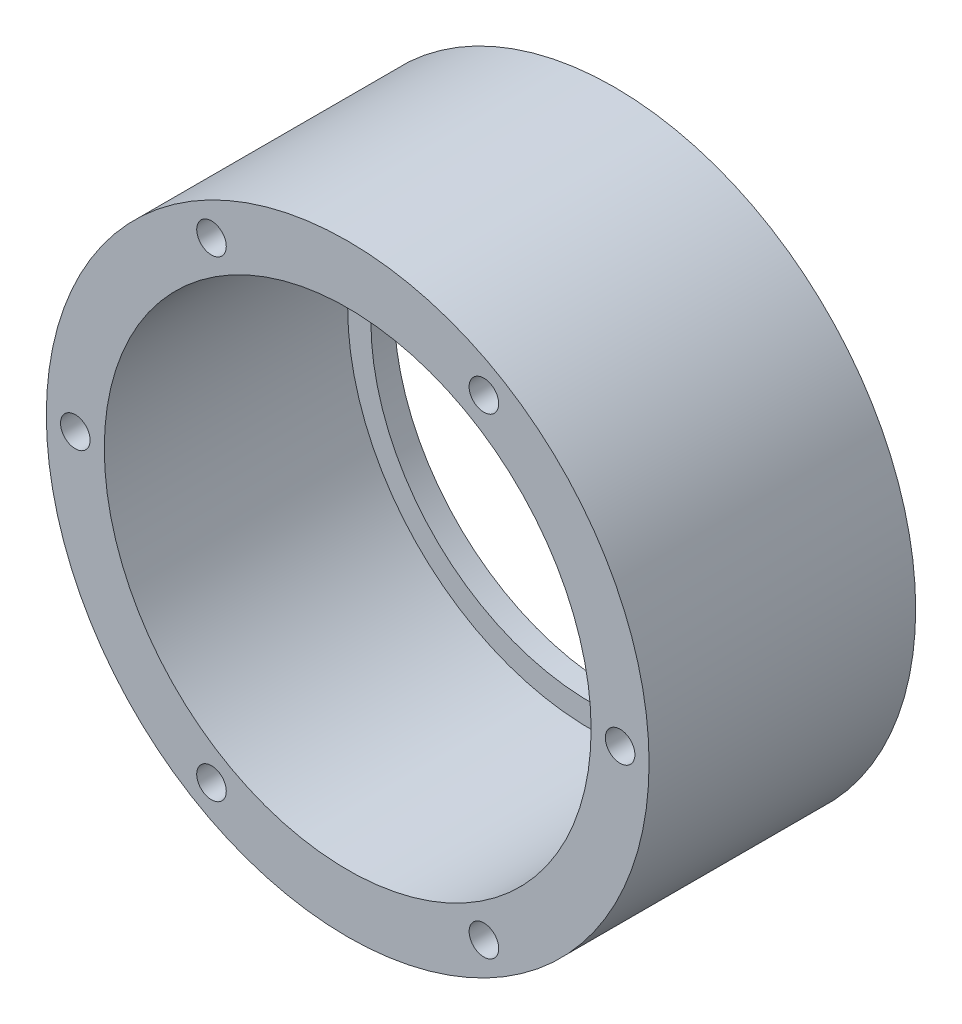
ISO-10303-21;
HEADER;
FILE_DESCRIPTION(('STEP AP214'),'2;1');
FILE_NAME('part.step','',(''),(''),'','','');
FILE_SCHEMA(('AUTOMOTIVE_DESIGN { 1 0 10303 214 1 1 1 1 }'));
ENDSEC;
DATA;
#1=APPLICATION_CONTEXT('core data for automotive mechanical design processes');
#2=APPLICATION_PROTOCOL_DEFINITION('international standard','automotive_design',2000,#1);
#3=PRODUCT_CONTEXT('',#1,'mechanical');
#4=PRODUCT('Part','Part','',(#3));
#5=PRODUCT_RELATED_PRODUCT_CATEGORY('part','',(#4));
#6=PRODUCT_DEFINITION_FORMATION('','',#4);
#7=PRODUCT_DEFINITION_CONTEXT('part definition',#1,'design');
#8=PRODUCT_DEFINITION('design','',#6,#7);
#9=PRODUCT_DEFINITION_SHAPE('','',#8);
#10=(LENGTH_UNIT() NAMED_UNIT(*) SI_UNIT(.MILLI.,.METRE.));
#11=(NAMED_UNIT(*) PLANE_ANGLE_UNIT() SI_UNIT($,.RADIAN.));
#12=(NAMED_UNIT(*) SI_UNIT($,.STERADIAN.) SOLID_ANGLE_UNIT());
#13=UNCERTAINTY_MEASURE_WITH_UNIT(LENGTH_MEASURE(1.E-05),#10,'distance_accuracy_value','');
#14=(GEOMETRIC_REPRESENTATION_CONTEXT(3) GLOBAL_UNCERTAINTY_ASSIGNED_CONTEXT((#13)) GLOBAL_UNIT_ASSIGNED_CONTEXT((#10,
#11,#12)) REPRESENTATION_CONTEXT('',''));
#15=CARTESIAN_POINT('',(0.,0.,0.));
#16=DIRECTION('',(0.,0.,1.));
#17=DIRECTION('',(1.,0.,0.));
#18=AXIS2_PLACEMENT_3D('',#15,#16,#17);
#19=CARTESIAN_POINT('',(0.,26.,-23.));
#20=DIRECTION('',(0.,0.,1.));
#21=DIRECTION('',(1.,0.,0.));
#22=AXIS2_PLACEMENT_3D('',#19,#20,#21);
#23=PLANE('',#22);
#24=CARTESIAN_POINT('',(0.,0.,-23.));
#25=DIRECTION('',(0.,0.,1.));
#26=DIRECTION('',(1.,0.,0.));
#27=AXIS2_PLACEMENT_3D('',#24,#25,#26);
#28=CIRCLE('',#27,26.);
#29=CARTESIAN_POINT('',(26.,0.,-23.));
#30=VERTEX_POINT('',#29);
#31=EDGE_CURVE('E105',#30,#30,#28,.T.);
#32=ORIENTED_EDGE('',*,*,#31,.F.);
#33=EDGE_LOOP('',(#32));
#34=FACE_BOUND('',#33,.T.);
#35=CARTESIAN_POINT('',(0.,0.,-23.));
#36=DIRECTION('',(0.,0.,1.));
#37=DIRECTION('',(1.,0.,0.));
#38=AXIS2_PLACEMENT_3D('',#35,#36,#37);
#39=CIRCLE('',#38,19.);
#40=CARTESIAN_POINT('',(19.,0.,-23.));
#41=VERTEX_POINT('',#40);
#42=EDGE_CURVE('E11',#41,#41,#39,.T.);
#43=ORIENTED_EDGE('',*,*,#42,.T.);
#44=EDGE_LOOP('',(#43));
#45=FACE_BOUND('',#44,.T.);
#46=ADVANCED_FACE('F34',(#34,#45),#23,.F.);
#47=CARTESIAN_POINT('',(0.,0.,0.));
#48=DIRECTION('',(0.,0.,1.));
#49=DIRECTION('',(1.,0.,0.));
#50=AXIS2_PLACEMENT_3D('',#47,#48,#49);
#51=CYLINDRICAL_SURFACE('',#50,19.);
#52=ORIENTED_EDGE('',*,*,#42,.F.);
#53=EDGE_LOOP('',(#52));
#54=FACE_BOUND('',#53,.T.);
#55=CARTESIAN_POINT('',(0.,0.,-21.));
#56=DIRECTION('',(0.,0.,1.));
#57=DIRECTION('',(1.,0.,0.));
#58=AXIS2_PLACEMENT_3D('',#55,#56,#57);
#59=CIRCLE('',#58,19.);
#60=CARTESIAN_POINT('',(19.,0.,-21.));
#61=VERTEX_POINT('',#60);
#62=EDGE_CURVE('E41',#61,#61,#59,.T.);
#63=ORIENTED_EDGE('',*,*,#62,.T.);
#64=EDGE_LOOP('',(#63));
#65=FACE_BOUND('',#64,.T.);
#66=ADVANCED_FACE('F119',(#54,#65),#51,.F.);
#67=CARTESIAN_POINT('',(0.,19.,-21.));
#68=DIRECTION('',(0.,0.,-1.));
#69=DIRECTION('',(-1.,0.,0.));
#70=AXIS2_PLACEMENT_3D('',#67,#68,#69);
#71=PLANE('',#70);
#72=ORIENTED_EDGE('',*,*,#62,.F.);
#73=EDGE_LOOP('',(#72));
#74=FACE_BOUND('',#73,.T.);
#75=CARTESIAN_POINT('',(0.,0.,-21.));
#76=DIRECTION('',(0.,0.,1.));
#77=DIRECTION('',(1.,0.,0.));
#78=AXIS2_PLACEMENT_3D('',#75,#76,#77);
#79=CIRCLE('',#78,21.);
#80=CARTESIAN_POINT('',(21.,0.,-21.));
#81=VERTEX_POINT('',#80);
#82=EDGE_CURVE('E114',#81,#81,#79,.T.);
#83=ORIENTED_EDGE('',*,*,#82,.T.);
#84=EDGE_LOOP('',(#83));
#85=FACE_BOUND('',#84,.T.);
#86=ADVANCED_FACE('F121',(#74,#85),#71,.F.);
#87=CARTESIAN_POINT('',(0.,0.,0.));
#88=DIRECTION('',(0.,0.,1.));
#89=DIRECTION('',(1.,0.,0.));
#90=AXIS2_PLACEMENT_3D('',#87,#88,#89);
#91=CYLINDRICAL_SURFACE('',#90,21.);
#92=ORIENTED_EDGE('',*,*,#82,.F.);
#93=EDGE_LOOP('',(#92));
#94=FACE_BOUND('',#93,.T.);
#95=CARTESIAN_POINT('',(0.,0.,0.));
#96=DIRECTION('',(0.,0.,1.));
#97=DIRECTION('',(1.,0.,0.));
#98=AXIS2_PLACEMENT_3D('',#95,#96,#97);
#99=CIRCLE('',#98,21.);
#100=CARTESIAN_POINT('',(21.,0.,0.));
#101=VERTEX_POINT('',#100);
#102=EDGE_CURVE('E111',#101,#101,#99,.T.);
#103=ORIENTED_EDGE('',*,*,#102,.T.);
#104=EDGE_LOOP('',(#103));
#105=FACE_BOUND('',#104,.T.);
#106=ADVANCED_FACE('F124',(#94,#105),#91,.F.);
#107=CARTESIAN_POINT('',(0.,21.,0.));
#108=DIRECTION('',(0.,0.,-1.));
#109=DIRECTION('',(-1.,0.,0.));
#110=AXIS2_PLACEMENT_3D('',#107,#108,#109);
#111=PLANE('',#110);
#112=CARTESIAN_POINT('',(11.7500000000002,-20.3515969889342,0.));
#113=DIRECTION('',(0.,0.,1.));
#114=DIRECTION('',(1.,0.,0.));
#115=AXIS2_PLACEMENT_3D('',#112,#113,#114);
#116=CIRCLE('',#115,1.275);
#117=CARTESIAN_POINT('',(13.0250000000002,-20.3515969889342,0.));
#118=VERTEX_POINT('',#117);
#119=EDGE_CURVE('E71',#118,#118,#116,.T.);
#120=ORIENTED_EDGE('',*,*,#119,.F.);
#121=EDGE_LOOP('',(#120));
#122=FACE_BOUND('',#121,.T.);
#123=CARTESIAN_POINT('',(-11.7499999999998,-20.3515969889344,0.));
#124=DIRECTION('',(0.,0.,1.));
#125=DIRECTION('',(1.,0.,0.));
#126=AXIS2_PLACEMENT_3D('',#123,#124,#125);
#127=CIRCLE('',#126,1.275);
#128=CARTESIAN_POINT('',(-10.4749999999998,-20.3515969889344,0.));
#129=VERTEX_POINT('',#128);
#130=EDGE_CURVE('E70',#129,#129,#127,.T.);
#131=ORIENTED_EDGE('',*,*,#130,.F.);
#132=EDGE_LOOP('',(#131));
#133=FACE_BOUND('',#132,.T.);
#134=CARTESIAN_POINT('',(-23.5,0.,0.));
#135=DIRECTION('',(0.,0.,1.));
#136=DIRECTION('',(1.,0.,0.));
#137=AXIS2_PLACEMENT_3D('',#134,#135,#136);
#138=CIRCLE('',#137,1.275);
#139=CARTESIAN_POINT('',(-22.225,0.,0.));
#140=VERTEX_POINT('',#139);
#141=EDGE_CURVE('E81',#140,#140,#138,.T.);
#142=ORIENTED_EDGE('',*,*,#141,.F.);
#143=EDGE_LOOP('',(#142));
#144=FACE_BOUND('',#143,.T.);
#145=CARTESIAN_POINT('',(-11.7500000000001,20.3515969889343,0.));
#146=DIRECTION('',(0.,0.,1.));
#147=DIRECTION('',(1.,0.,0.));
#148=AXIS2_PLACEMENT_3D('',#145,#146,#147);
#149=CIRCLE('',#148,1.275);
#150=CARTESIAN_POINT('',(-10.4750000000001,20.3515969889343,0.));
#151=VERTEX_POINT('',#150);
#152=EDGE_CURVE('E87',#151,#151,#149,.T.);
#153=ORIENTED_EDGE('',*,*,#152,.F.);
#154=EDGE_LOOP('',(#153));
#155=FACE_BOUND('',#154,.T.);
#156=CARTESIAN_POINT('',(11.75,20.3515969889343,0.));
#157=DIRECTION('',(0.,0.,1.));
#158=DIRECTION('',(1.,0.,0.));
#159=AXIS2_PLACEMENT_3D('',#156,#157,#158);
#160=CIRCLE('',#159,1.275);
#161=CARTESIAN_POINT('',(13.025,20.3515969889343,0.));
#162=VERTEX_POINT('',#161);
#163=EDGE_CURVE('E93',#162,#162,#160,.T.);
#164=ORIENTED_EDGE('',*,*,#163,.F.);
#165=EDGE_LOOP('',(#164));
#166=FACE_BOUND('',#165,.T.);
#167=CARTESIAN_POINT('',(23.5,0.,0.));
#168=DIRECTION('',(0.,0.,1.));
#169=DIRECTION('',(1.,0.,0.));
#170=AXIS2_PLACEMENT_3D('',#167,#168,#169);
#171=CIRCLE('',#170,1.275);
#172=CARTESIAN_POINT('',(24.775,0.,0.));
#173=VERTEX_POINT('',#172);
#174=EDGE_CURVE('E99',#173,#173,#171,.T.);
#175=ORIENTED_EDGE('',*,*,#174,.F.);
#176=EDGE_LOOP('',(#175));
#177=FACE_BOUND('',#176,.T.);
#178=ORIENTED_EDGE('',*,*,#102,.F.);
#179=EDGE_LOOP('',(#178));
#180=FACE_BOUND('',#179,.T.);
#181=CARTESIAN_POINT('',(0.,0.,0.));
#182=DIRECTION('',(0.,0.,1.));
#183=DIRECTION('',(1.,0.,0.));
#184=AXIS2_PLACEMENT_3D('',#181,#182,#183);
#185=CIRCLE('',#184,26.);
#186=CARTESIAN_POINT('',(26.,0.,0.));
#187=VERTEX_POINT('',#186);
#188=EDGE_CURVE('E108',#187,#187,#185,.T.);
#189=ORIENTED_EDGE('',*,*,#188,.T.);
#190=EDGE_LOOP('',(#189));
#191=FACE_BOUND('',#190,.T.);
#192=ADVANCED_FACE('F130',(#122,#133,#144,#155,#166,#177,#180,#191),#111,.F.);
#193=CARTESIAN_POINT('',(0.,0.,0.));
#194=DIRECTION('',(0.,0.,1.));
#195=DIRECTION('',(1.,0.,0.));
#196=AXIS2_PLACEMENT_3D('',#193,#194,#195);
#197=CYLINDRICAL_SURFACE('',#196,26.);
#198=ORIENTED_EDGE('',*,*,#188,.F.);
#199=EDGE_LOOP('',(#198));
#200=FACE_BOUND('',#199,.T.);
#201=ORIENTED_EDGE('',*,*,#31,.T.);
#202=EDGE_LOOP('',(#201));
#203=FACE_BOUND('',#202,.T.);
#204=ADVANCED_FACE('F136',(#200,#203),#197,.T.);
#205=CARTESIAN_POINT('',(23.5,0.,-8.));
#206=DIRECTION('',(0.,0.,1.));
#207=DIRECTION('',(1.,0.,0.));
#208=AXIS2_PLACEMENT_3D('',#205,#206,#207);
#209=CONICAL_SURFACE('',#208,1.275,1.02974425867665);
#210=CARTESIAN_POINT('',(23.5,0.,-8.76609728926014));
#211=VERTEX_POINT('',#210);
#212=VERTEX_LOOP('',#211);
#213=FACE_BOUND('',#212,.T.);
#214=CARTESIAN_POINT('',(23.5,0.,-8.));
#215=DIRECTION('',(0.,0.,1.));
#216=DIRECTION('',(1.,0.,0.));
#217=AXIS2_PLACEMENT_3D('',#214,#215,#216);
#218=CIRCLE('',#217,1.275);
#219=CARTESIAN_POINT('',(24.775,0.,-8.));
#220=VERTEX_POINT('',#219);
#221=EDGE_CURVE('E102',#220,#220,#218,.T.);
#222=ORIENTED_EDGE('',*,*,#221,.T.);
#223=EDGE_LOOP('',(#222));
#224=FACE_BOUND('',#223,.T.);
#225=ADVANCED_FACE('F143',(#213,#224),#209,.F.);
#226=CARTESIAN_POINT('',(23.5,0.,0.));
#227=DIRECTION('',(0.,0.,1.));
#228=DIRECTION('',(1.,0.,0.));
#229=AXIS2_PLACEMENT_3D('',#226,#227,#228);
#230=CYLINDRICAL_SURFACE('',#229,1.275);
#231=ORIENTED_EDGE('',*,*,#221,.F.);
#232=EDGE_LOOP('',(#231));
#233=FACE_BOUND('',#232,.T.);
#234=ORIENTED_EDGE('',*,*,#174,.T.);
#235=EDGE_LOOP('',(#234));
#236=FACE_BOUND('',#235,.T.);
#237=ADVANCED_FACE('F157',(#233,#236),#230,.F.);
#238=CARTESIAN_POINT('',(11.75,20.3515969889343,-8.));
#239=DIRECTION('',(0.,0.,1.));
#240=DIRECTION('',(1.,0.,0.));
#241=AXIS2_PLACEMENT_3D('',#238,#239,#240);
#242=CONICAL_SURFACE('',#241,1.275,1.02974425867665);
#243=CARTESIAN_POINT('',(11.75,20.3515969889343,-8.76609728926014));
#244=VERTEX_POINT('',#243);
#245=VERTEX_LOOP('',#244);
#246=FACE_BOUND('',#245,.T.);
#247=CARTESIAN_POINT('',(11.75,20.3515969889343,-8.));
#248=DIRECTION('',(0.,0.,1.));
#249=DIRECTION('',(1.,0.,0.));
#250=AXIS2_PLACEMENT_3D('',#247,#248,#249);
#251=CIRCLE('',#250,1.275);
#252=CARTESIAN_POINT('',(13.025,20.3515969889343,-8.));
#253=VERTEX_POINT('',#252);
#254=EDGE_CURVE('E96',#253,#253,#251,.T.);
#255=ORIENTED_EDGE('',*,*,#254,.T.);
#256=EDGE_LOOP('',(#255));
#257=FACE_BOUND('',#256,.T.);
#258=ADVANCED_FACE('F160',(#246,#257),#242,.F.);
#259=CARTESIAN_POINT('',(11.75,20.3515969889343,0.));
#260=DIRECTION('',(0.,0.,1.));
#261=DIRECTION('',(1.,0.,0.));
#262=AXIS2_PLACEMENT_3D('',#259,#260,#261);
#263=CYLINDRICAL_SURFACE('',#262,1.275);
#264=ORIENTED_EDGE('',*,*,#254,.F.);
#265=EDGE_LOOP('',(#264));
#266=FACE_BOUND('',#265,.T.);
#267=ORIENTED_EDGE('',*,*,#163,.T.);
#268=EDGE_LOOP('',(#267));
#269=FACE_BOUND('',#268,.T.);
#270=ADVANCED_FACE('F164',(#266,#269),#263,.F.);
#271=CARTESIAN_POINT('',(-11.7500000000001,20.3515969889343,-8.));
#272=DIRECTION('',(0.,0.,1.));
#273=DIRECTION('',(1.,0.,0.));
#274=AXIS2_PLACEMENT_3D('',#271,#272,#273);
#275=CONICAL_SURFACE('',#274,1.275,1.02974425867665);
#276=CARTESIAN_POINT('',(-11.7500000000001,20.3515969889343,-8.76609728926014));
#277=VERTEX_POINT('',#276);
#278=VERTEX_LOOP('',#277);
#279=FACE_BOUND('',#278,.T.);
#280=CARTESIAN_POINT('',(-11.7500000000001,20.3515969889343,-8.));
#281=DIRECTION('',(0.,0.,1.));
#282=DIRECTION('',(1.,0.,0.));
#283=AXIS2_PLACEMENT_3D('',#280,#281,#282);
#284=CIRCLE('',#283,1.275);
#285=CARTESIAN_POINT('',(-10.4750000000001,20.3515969889343,-8.));
#286=VERTEX_POINT('',#285);
#287=EDGE_CURVE('E90',#286,#286,#284,.T.);
#288=ORIENTED_EDGE('',*,*,#287,.T.);
#289=EDGE_LOOP('',(#288));
#290=FACE_BOUND('',#289,.T.);
#291=ADVANCED_FACE('F167',(#279,#290),#275,.F.);
#292=CARTESIAN_POINT('',(-11.7500000000001,20.3515969889343,0.));
#293=DIRECTION('',(0.,0.,1.));
#294=DIRECTION('',(1.,0.,0.));
#295=AXIS2_PLACEMENT_3D('',#292,#293,#294);
#296=CYLINDRICAL_SURFACE('',#295,1.275);
#297=ORIENTED_EDGE('',*,*,#287,.F.);
#298=EDGE_LOOP('',(#297));
#299=FACE_BOUND('',#298,.T.);
#300=ORIENTED_EDGE('',*,*,#152,.T.);
#301=EDGE_LOOP('',(#300));
#302=FACE_BOUND('',#301,.T.);
#303=ADVANCED_FACE('F171',(#299,#302),#296,.F.);
#304=CARTESIAN_POINT('',(-23.5,0.,-8.));
#305=DIRECTION('',(0.,0.,1.));
#306=DIRECTION('',(1.,0.,0.));
#307=AXIS2_PLACEMENT_3D('',#304,#305,#306);
#308=CONICAL_SURFACE('',#307,1.275,1.02974425867665);
#309=CARTESIAN_POINT('',(-23.5,0.,-8.76609728926014));
#310=VERTEX_POINT('',#309);
#311=VERTEX_LOOP('',#310);
#312=FACE_BOUND('',#311,.T.);
#313=CARTESIAN_POINT('',(-23.5,0.,-8.));
#314=DIRECTION('',(0.,0.,1.));
#315=DIRECTION('',(1.,0.,0.));
#316=AXIS2_PLACEMENT_3D('',#313,#314,#315);
#317=CIRCLE('',#316,1.275);
#318=CARTESIAN_POINT('',(-22.225,0.,-8.));
#319=VERTEX_POINT('',#318);
#320=EDGE_CURVE('E84',#319,#319,#317,.T.);
#321=ORIENTED_EDGE('',*,*,#320,.T.);
#322=EDGE_LOOP('',(#321));
#323=FACE_BOUND('',#322,.T.);
#324=ADVANCED_FACE('F175',(#312,#323),#308,.F.);
#325=CARTESIAN_POINT('',(-23.5,0.,0.));
#326=DIRECTION('',(0.,0.,1.));
#327=DIRECTION('',(1.,0.,0.));
#328=AXIS2_PLACEMENT_3D('',#325,#326,#327);
#329=CYLINDRICAL_SURFACE('',#328,1.275);
#330=ORIENTED_EDGE('',*,*,#320,.F.);
#331=EDGE_LOOP('',(#330));
#332=FACE_BOUND('',#331,.T.);
#333=ORIENTED_EDGE('',*,*,#141,.T.);
#334=EDGE_LOOP('',(#333));
#335=FACE_BOUND('',#334,.T.);
#336=ADVANCED_FACE('F179',(#332,#335),#329,.F.);
#337=CARTESIAN_POINT('',(-11.7499999999998,-20.3515969889344,-8.));
#338=DIRECTION('',(0.,0.,1.));
#339=DIRECTION('',(1.,0.,0.));
#340=AXIS2_PLACEMENT_3D('',#337,#338,#339);
#341=CONICAL_SURFACE('',#340,1.275,1.02974425867665);
#342=CARTESIAN_POINT('',(-11.7499999999998,-20.3515969889344,-8.76609728926014));
#343=VERTEX_POINT('',#342);
#344=VERTEX_LOOP('',#343);
#345=FACE_BOUND('',#344,.T.);
#346=CARTESIAN_POINT('',(-11.7499999999998,-20.3515969889344,-8.));
#347=DIRECTION('',(0.,0.,1.));
#348=DIRECTION('',(1.,0.,0.));
#349=AXIS2_PLACEMENT_3D('',#346,#347,#348);
#350=CIRCLE('',#349,1.275);
#351=CARTESIAN_POINT('',(-10.4749999999998,-20.3515969889344,-8.));
#352=VERTEX_POINT('',#351);
#353=EDGE_CURVE('E74',#352,#352,#350,.T.);
#354=ORIENTED_EDGE('',*,*,#353,.T.);
#355=EDGE_LOOP('',(#354));
#356=FACE_BOUND('',#355,.T.);
#357=ADVANCED_FACE('F183',(#345,#356),#341,.F.);
#358=CARTESIAN_POINT('',(-11.7499999999998,-20.3515969889344,0.));
#359=DIRECTION('',(0.,0.,1.));
#360=DIRECTION('',(1.,0.,0.));
#361=AXIS2_PLACEMENT_3D('',#358,#359,#360);
#362=CYLINDRICAL_SURFACE('',#361,1.275);
#363=ORIENTED_EDGE('',*,*,#353,.F.);
#364=EDGE_LOOP('',(#363));
#365=FACE_BOUND('',#364,.T.);
#366=ORIENTED_EDGE('',*,*,#130,.T.);
#367=EDGE_LOOP('',(#366));
#368=FACE_BOUND('',#367,.T.);
#369=ADVANCED_FACE('F64',(#365,#368),#362,.F.);
#370=CARTESIAN_POINT('',(11.7500000000002,-20.3515969889342,-8.));
#371=DIRECTION('',(0.,0.,1.));
#372=DIRECTION('',(1.,0.,0.));
#373=AXIS2_PLACEMENT_3D('',#370,#371,#372);
#374=CONICAL_SURFACE('',#373,1.275,1.02974425867665);
#375=CARTESIAN_POINT('',(11.7500000000002,-20.3515969889342,-8.76609728926014));
#376=VERTEX_POINT('',#375);
#377=VERTEX_LOOP('',#376);
#378=FACE_BOUND('',#377,.T.);
#379=CARTESIAN_POINT('',(11.7500000000002,-20.3515969889342,-8.));
#380=DIRECTION('',(0.,0.,1.));
#381=DIRECTION('',(1.,0.,0.));
#382=AXIS2_PLACEMENT_3D('',#379,#380,#381);
#383=CIRCLE('',#382,1.275);
#384=CARTESIAN_POINT('',(13.0250000000002,-20.3515969889342,-8.));
#385=VERTEX_POINT('',#384);
#386=EDGE_CURVE('E68',#385,#385,#383,.T.);
#387=ORIENTED_EDGE('',*,*,#386,.T.);
#388=EDGE_LOOP('',(#387));
#389=FACE_BOUND('',#388,.T.);
#390=ADVANCED_FACE('F60',(#378,#389),#374,.F.);
#391=CARTESIAN_POINT('',(11.7500000000002,-20.3515969889342,0.));
#392=DIRECTION('',(0.,0.,1.));
#393=DIRECTION('',(1.,0.,0.));
#394=AXIS2_PLACEMENT_3D('',#391,#392,#393);
#395=CYLINDRICAL_SURFACE('',#394,1.275);
#396=ORIENTED_EDGE('',*,*,#386,.F.);
#397=EDGE_LOOP('',(#396));
#398=FACE_BOUND('',#397,.T.);
#399=ORIENTED_EDGE('',*,*,#119,.T.);
#400=EDGE_LOOP('',(#399));
#401=FACE_BOUND('',#400,.T.);
#402=ADVANCED_FACE('F63',(#398,#401),#395,.F.);
#403=CLOSED_SHELL('',(#46,#66,#86,#106,#192,#204,#225,#237,#258,#270,#291,#303,#324,#336,#357,
#369,#390,#402));
#404=MANIFOLD_SOLID_BREP('B2',#403);
#405=ADVANCED_BREP_SHAPE_REPRESENTATION('',(#18,#404),#14);
#406=SHAPE_DEFINITION_REPRESENTATION(#9,#405);
ENDSEC;
END-ISO-10303-21;
